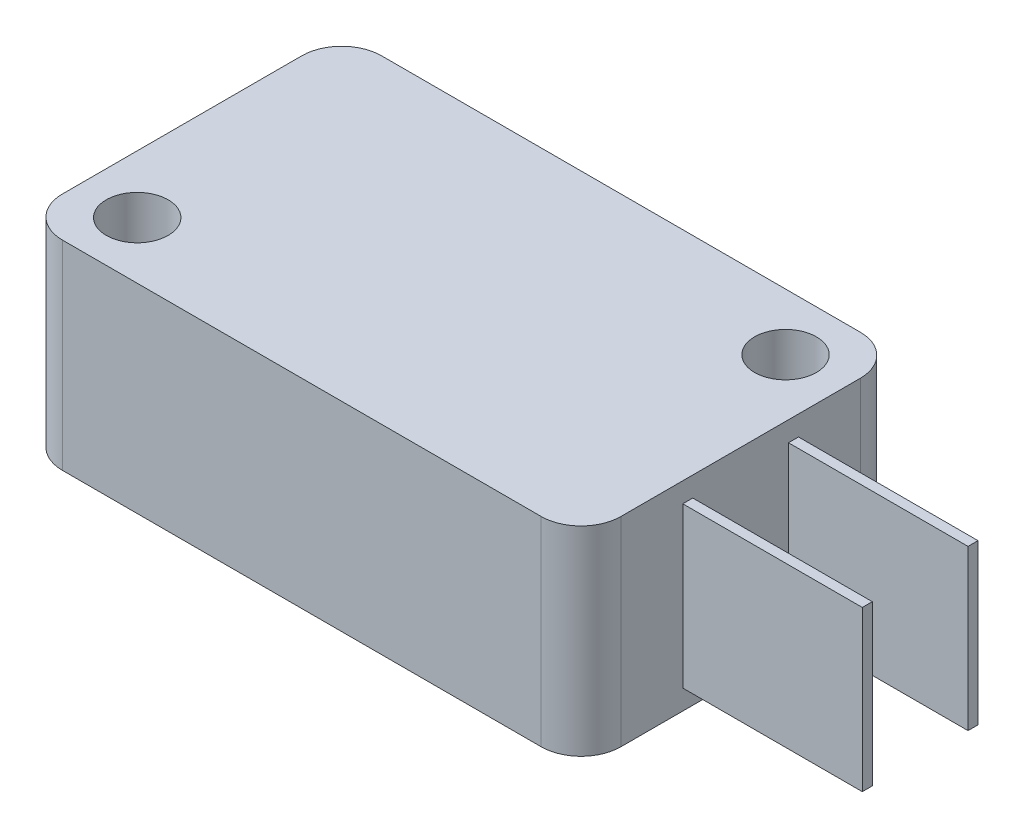
ISO-10303-21;
HEADER;
FILE_DESCRIPTION(('STEP AP214'),'2;1');
FILE_NAME('part.step','',(''),(''),'','','');
FILE_SCHEMA(('AUTOMOTIVE_DESIGN { 1 0 10303 214 1 1 1 1 }'));
ENDSEC;
DATA;
#1=APPLICATION_CONTEXT('core data for automotive mechanical design processes');
#2=APPLICATION_PROTOCOL_DEFINITION('international standard','automotive_design',2000,#1);
#3=PRODUCT_CONTEXT('',#1,'mechanical');
#4=PRODUCT('Part','Part','',(#3));
#5=PRODUCT_RELATED_PRODUCT_CATEGORY('part','',(#4));
#6=PRODUCT_DEFINITION_FORMATION('','',#4);
#7=PRODUCT_DEFINITION_CONTEXT('part definition',#1,'design');
#8=PRODUCT_DEFINITION('design','',#6,#7);
#9=PRODUCT_DEFINITION_SHAPE('','',#8);
#10=(LENGTH_UNIT() NAMED_UNIT(*) SI_UNIT(.MILLI.,.METRE.));
#11=(NAMED_UNIT(*) PLANE_ANGLE_UNIT() SI_UNIT($,.RADIAN.));
#12=(NAMED_UNIT(*) SI_UNIT($,.STERADIAN.) SOLID_ANGLE_UNIT());
#13=UNCERTAINTY_MEASURE_WITH_UNIT(LENGTH_MEASURE(1.E-05),#10,'distance_accuracy_value','');
#14=(GEOMETRIC_REPRESENTATION_CONTEXT(3) GLOBAL_UNCERTAINTY_ASSIGNED_CONTEXT((#13)) GLOBAL_UNIT_ASSIGNED_CONTEXT((#10,
#11,#12)) REPRESENTATION_CONTEXT('',''));
#15=CARTESIAN_POINT('',(0.,0.,0.));
#16=DIRECTION('',(0.,0.,1.));
#17=DIRECTION('',(1.,0.,0.));
#18=AXIS2_PLACEMENT_3D('',#15,#16,#17);
#19=CARTESIAN_POINT('',(-14.,10.,-8.));
#20=DIRECTION('',(0.,0.,1.));
#21=DIRECTION('',(1.,0.,0.));
#22=AXIS2_PLACEMENT_3D('',#19,#20,#21);
#23=PLANE('',#22);
#24=DIRECTION('',(-1.,0.,0.));
#25=VECTOR('',#24,1.);
#26=CARTESIAN_POINT('',(-14.,0.,-8.));
#27=LINE('',#26,#25);
#28=CARTESIAN_POINT('',(12.,0.,-8.));
#29=VERTEX_POINT('',#28);
#30=CARTESIAN_POINT('',(-12.,0.,-8.));
#31=VERTEX_POINT('',#30);
#32=EDGE_CURVE('E300',#29,#31,#27,.T.);
#33=ORIENTED_EDGE('',*,*,#32,.T.);
#34=DIRECTION('',(0.,-1.,0.));
#35=VECTOR('',#34,1.);
#36=CARTESIAN_POINT('',(-12.,10.,-8.));
#37=LINE('',#36,#35);
#38=CARTESIAN_POINT('',(-12.,10.,-8.));
#39=VERTEX_POINT('',#38);
#40=EDGE_CURVE('E335',#31,#39,#37,.F.);
#41=ORIENTED_EDGE('',*,*,#40,.T.);
#42=DIRECTION('',(-1.,0.,0.));
#43=VECTOR('',#42,1.);
#44=CARTESIAN_POINT('',(-14.,10.,-8.));
#45=LINE('',#44,#43);
#46=CARTESIAN_POINT('',(12.,10.,-8.));
#47=VERTEX_POINT('',#46);
#48=EDGE_CURVE('E306',#47,#39,#45,.T.);
#49=ORIENTED_EDGE('',*,*,#48,.F.);
#50=DIRECTION('',(0.,-1.,0.));
#51=VECTOR('',#50,1.);
#52=CARTESIAN_POINT('',(12.,10.,-8.));
#53=LINE('',#52,#51);
#54=EDGE_CURVE('E332',#47,#29,#53,.T.);
#55=ORIENTED_EDGE('',*,*,#54,.T.);
#56=EDGE_LOOP('',(#33,#41,#49,#55));
#57=FACE_BOUND('',#56,.T.);
#58=DIRECTION('',(0.,-1.,0.));
#59=VECTOR('',#58,1.);
#60=CARTESIAN_POINT('',(-4.96556421839944,6.5,-8.));
#61=LINE('',#60,#59);
#62=CARTESIAN_POINT('',(-4.96556421839944,6.5,-8.));
#63=VERTEX_POINT('',#62);
#64=CARTESIAN_POINT('',(-4.96556421839944,3.5,-8.));
#65=VERTEX_POINT('',#64);
#66=EDGE_CURVE('E185',#63,#65,#61,.T.);
#67=ORIENTED_EDGE('',*,*,#66,.F.);
#68=DIRECTION('',(1.,0.,0.));
#69=VECTOR('',#68,1.);
#70=CARTESIAN_POINT('',(-4.96556421839944,6.5,-8.));
#71=LINE('',#70,#69);
#72=CARTESIAN_POINT('',(-7.96556421839944,6.5,-8.));
#73=VERTEX_POINT('',#72);
#74=EDGE_CURVE('E197',#73,#63,#71,.T.);
#75=ORIENTED_EDGE('',*,*,#74,.F.);
#76=DIRECTION('',(0.,1.,0.));
#77=VECTOR('',#76,1.);
#78=CARTESIAN_POINT('',(-7.96556421839944,6.5,-8.));
#79=LINE('',#78,#77);
#80=CARTESIAN_POINT('',(-7.96556421839944,3.5,-8.));
#81=VERTEX_POINT('',#80);
#82=EDGE_CURVE('E205',#81,#73,#79,.T.);
#83=ORIENTED_EDGE('',*,*,#82,.F.);
#84=DIRECTION('',(-1.,0.,0.));
#85=VECTOR('',#84,1.);
#86=CARTESIAN_POINT('',(-4.96556421839944,3.5,-8.));
#87=LINE('',#86,#85);
#88=EDGE_CURVE('E200',#65,#81,#87,.T.);
#89=ORIENTED_EDGE('',*,*,#88,.F.);
#90=EDGE_LOOP('',(#67,#75,#83,#89));
#91=FACE_BOUND('',#90,.T.);
#92=ADVANCED_FACE('F33',(#57,#91),#23,.F.);
#93=CARTESIAN_POINT('',(14.,10.,-8.));
#94=DIRECTION('',(-1.,0.,0.));
#95=DIRECTION('',(0.,0.,1.));
#96=AXIS2_PLACEMENT_3D('',#93,#94,#95);
#97=PLANE('',#96);
#98=DIRECTION('',(0.,-1.,0.));
#99=VECTOR('',#98,1.);
#100=CARTESIAN_POINT('',(14.,9.,2.9));
#101=LINE('',#100,#99);
#102=CARTESIAN_POINT('',(14.,9.,2.9));
#103=VERTEX_POINT('',#102);
#104=CARTESIAN_POINT('',(14.,1.,2.89999999999999));
#105=VERTEX_POINT('',#104);
#106=EDGE_CURVE('E250',#103,#105,#101,.T.);
#107=ORIENTED_EDGE('',*,*,#106,.F.);
#108=DIRECTION('',(0.,0.,1.));
#109=VECTOR('',#108,1.);
#110=CARTESIAN_POINT('',(14.,9.,2.9));
#111=LINE('',#110,#109);
#112=CARTESIAN_POINT('',(14.,9.,2.39999999999999));
#113=VERTEX_POINT('',#112);
#114=EDGE_CURVE('E255',#113,#103,#111,.T.);
#115=ORIENTED_EDGE('',*,*,#114,.F.);
#116=DIRECTION('',(0.,1.,0.));
#117=VECTOR('',#116,1.);
#118=CARTESIAN_POINT('',(14.,9.,2.4));
#119=LINE('',#118,#117);
#120=CARTESIAN_POINT('',(14.,1.,2.4));
#121=VERTEX_POINT('',#120);
#122=EDGE_CURVE('E267',#121,#113,#119,.T.);
#123=ORIENTED_EDGE('',*,*,#122,.F.);
#124=DIRECTION('',(0.,0.,-1.));
#125=VECTOR('',#124,1.);
#126=CARTESIAN_POINT('',(14.,1.,2.89999999999999));
#127=LINE('',#126,#125);
#128=EDGE_CURVE('E264',#105,#121,#127,.T.);
#129=ORIENTED_EDGE('',*,*,#128,.F.);
#130=EDGE_LOOP('',(#107,#115,#123,#129));
#131=FACE_BOUND('',#130,.T.);
#132=DIRECTION('',(0.,0.,-1.));
#133=VECTOR('',#132,1.);
#134=CARTESIAN_POINT('',(14.,0.,-8.));
#135=LINE('',#134,#133);
#136=CARTESIAN_POINT('',(14.,0.,6.));
#137=VERTEX_POINT('',#136);
#138=CARTESIAN_POINT('',(14.,0.,-6.));
#139=VERTEX_POINT('',#138);
#140=EDGE_CURVE('E315',#137,#139,#135,.T.);
#141=ORIENTED_EDGE('',*,*,#140,.T.);
#142=DIRECTION('',(0.,-1.,0.));
#143=VECTOR('',#142,1.);
#144=CARTESIAN_POINT('',(14.,10.,-6.));
#145=LINE('',#144,#143);
#146=CARTESIAN_POINT('',(14.,10.,-6.));
#147=VERTEX_POINT('',#146);
#148=EDGE_CURVE('E348',#139,#147,#145,.F.);
#149=ORIENTED_EDGE('',*,*,#148,.T.);
#150=DIRECTION('',(0.,0.,-1.));
#151=VECTOR('',#150,1.);
#152=CARTESIAN_POINT('',(14.,10.,-8.));
#153=LINE('',#152,#151);
#154=CARTESIAN_POINT('',(14.,10.,6.));
#155=VERTEX_POINT('',#154);
#156=EDGE_CURVE('E303',#155,#147,#153,.T.);
#157=ORIENTED_EDGE('',*,*,#156,.F.);
#158=DIRECTION('',(0.,-1.,0.));
#159=VECTOR('',#158,1.);
#160=CARTESIAN_POINT('',(14.,10.,6.));
#161=LINE('',#160,#159);
#162=EDGE_CURVE('E345',#155,#137,#161,.T.);
#163=ORIENTED_EDGE('',*,*,#162,.T.);
#164=EDGE_LOOP('',(#141,#149,#157,#163));
#165=FACE_BOUND('',#164,.T.);
#166=DIRECTION('',(0.,-1.,0.));
#167=VECTOR('',#166,1.);
#168=CARTESIAN_POINT('',(14.,9.,-2.4));
#169=LINE('',#168,#167);
#170=CARTESIAN_POINT('',(14.,9.,-2.4));
#171=VERTEX_POINT('',#170);
#172=CARTESIAN_POINT('',(14.,1.,-2.4));
#173=VERTEX_POINT('',#172);
#174=EDGE_CURVE('E217',#171,#173,#169,.T.);
#175=ORIENTED_EDGE('',*,*,#174,.F.);
#176=DIRECTION('',(0.,0.,1.));
#177=VECTOR('',#176,1.);
#178=CARTESIAN_POINT('',(14.,9.,-2.4));
#179=LINE('',#178,#177);
#180=CARTESIAN_POINT('',(14.,9.,-2.90000000000001));
#181=VERTEX_POINT('',#180);
#182=EDGE_CURVE('E222',#181,#171,#179,.T.);
#183=ORIENTED_EDGE('',*,*,#182,.F.);
#184=DIRECTION('',(0.,1.,0.));
#185=VECTOR('',#184,1.);
#186=CARTESIAN_POINT('',(14.,9.,-2.9));
#187=LINE('',#186,#185);
#188=CARTESIAN_POINT('',(14.,1.,-2.90000000000001));
#189=VERTEX_POINT('',#188);
#190=EDGE_CURVE('E234',#189,#181,#187,.T.);
#191=ORIENTED_EDGE('',*,*,#190,.F.);
#192=DIRECTION('',(0.,0.,-1.));
#193=VECTOR('',#192,1.);
#194=CARTESIAN_POINT('',(14.,1.,-2.40000000000001));
#195=LINE('',#194,#193);
#196=EDGE_CURVE('E231',#173,#189,#195,.T.);
#197=ORIENTED_EDGE('',*,*,#196,.F.);
#198=EDGE_LOOP('',(#175,#183,#191,#197));
#199=FACE_BOUND('',#198,.T.);
#200=ADVANCED_FACE('F383',(#131,#165,#199),#97,.F.);
#201=CARTESIAN_POINT('',(-14.,10.,-8.));
#202=DIRECTION('',(1.,0.,0.));
#203=DIRECTION('',(0.,0.,-1.));
#204=AXIS2_PLACEMENT_3D('',#201,#202,#203);
#205=PLANE('',#204);
#206=DIRECTION('',(0.,0.,1.));
#207=VECTOR('',#206,1.);
#208=CARTESIAN_POINT('',(-14.,10.,-8.));
#209=LINE('',#208,#207);
#210=CARTESIAN_POINT('',(-14.,10.,-6.));
#211=VERTEX_POINT('',#210);
#212=CARTESIAN_POINT('',(-14.,10.,6.));
#213=VERTEX_POINT('',#212);
#214=EDGE_CURVE('E296',#211,#213,#209,.T.);
#215=ORIENTED_EDGE('',*,*,#214,.F.);
#216=DIRECTION('',(0.,-1.,0.));
#217=VECTOR('',#216,1.);
#218=CARTESIAN_POINT('',(-14.,10.,-6.));
#219=LINE('',#218,#217);
#220=CARTESIAN_POINT('',(-14.,0.,-6.));
#221=VERTEX_POINT('',#220);
#222=EDGE_CURVE('E321',#211,#221,#219,.T.);
#223=ORIENTED_EDGE('',*,*,#222,.T.);
#224=DIRECTION('',(0.,0.,1.));
#225=VECTOR('',#224,1.);
#226=CARTESIAN_POINT('',(-14.,0.,-8.));
#227=LINE('',#226,#225);
#228=CARTESIAN_POINT('',(-14.,0.,6.));
#229=VERTEX_POINT('',#228);
#230=EDGE_CURVE('E293',#221,#229,#227,.T.);
#231=ORIENTED_EDGE('',*,*,#230,.T.);
#232=DIRECTION('',(0.,-1.,0.));
#233=VECTOR('',#232,1.);
#234=CARTESIAN_POINT('',(-14.,10.,6.));
#235=LINE('',#234,#233);
#236=EDGE_CURVE('E309',#229,#213,#235,.F.);
#237=ORIENTED_EDGE('',*,*,#236,.T.);
#238=EDGE_LOOP('',(#215,#223,#231,#237));
#239=FACE_BOUND('',#238,.T.);
#240=ADVANCED_FACE('F389',(#239),#205,.F.);
#241=CARTESIAN_POINT('',(-14.,10.,8.));
#242=DIRECTION('',(0.,0.,-1.));
#243=DIRECTION('',(-1.,0.,0.));
#244=AXIS2_PLACEMENT_3D('',#241,#242,#243);
#245=PLANE('',#244);
#246=DIRECTION('',(1.,0.,0.));
#247=VECTOR('',#246,1.);
#248=CARTESIAN_POINT('',(-14.,0.,8.));
#249=LINE('',#248,#247);
#250=CARTESIAN_POINT('',(-12.,0.,8.));
#251=VERTEX_POINT('',#250);
#252=CARTESIAN_POINT('',(12.,0.,8.));
#253=VERTEX_POINT('',#252);
#254=EDGE_CURVE('E312',#251,#253,#249,.T.);
#255=ORIENTED_EDGE('',*,*,#254,.T.);
#256=DIRECTION('',(0.,-1.,0.));
#257=VECTOR('',#256,1.);
#258=CARTESIAN_POINT('',(12.,10.,8.));
#259=LINE('',#258,#257);
#260=CARTESIAN_POINT('',(12.,10.,8.));
#261=VERTEX_POINT('',#260);
#262=EDGE_CURVE('E353',#253,#261,#259,.F.);
#263=ORIENTED_EDGE('',*,*,#262,.T.);
#264=DIRECTION('',(1.,0.,0.));
#265=VECTOR('',#264,1.);
#266=CARTESIAN_POINT('',(-14.,10.,8.));
#267=LINE('',#266,#265);
#268=CARTESIAN_POINT('',(-12.,10.,8.));
#269=VERTEX_POINT('',#268);
#270=EDGE_CURVE('E299',#269,#261,#267,.T.);
#271=ORIENTED_EDGE('',*,*,#270,.F.);
#272=DIRECTION('',(0.,-1.,0.));
#273=VECTOR('',#272,1.);
#274=CARTESIAN_POINT('',(-12.,10.,8.));
#275=LINE('',#274,#273);
#276=EDGE_CURVE('E350',#269,#251,#275,.T.);
#277=ORIENTED_EDGE('',*,*,#276,.T.);
#278=EDGE_LOOP('',(#255,#263,#271,#277));
#279=FACE_BOUND('',#278,.T.);
#280=ADVANCED_FACE('F396',(#279),#245,.F.);
#281=CARTESIAN_POINT('',(0.,10.,0.));
#282=DIRECTION('',(0.,1.,0.));
#283=DIRECTION('',(0.,0.,1.));
#284=AXIS2_PLACEMENT_3D('',#281,#282,#283);
#285=PLANE('',#284);
#286=CARTESIAN_POINT('',(-11.0999999999995,10.,5.14999999999311));
#287=DIRECTION('',(0.,1.,0.));
#288=DIRECTION('',(0.,0.,1.));
#289=AXIS2_PLACEMENT_3D('',#286,#287,#288);
#290=CIRCLE('',#289,1.55);
#291=CARTESIAN_POINT('',(-11.0999999999995,10.,6.69999999999311));
#292=VERTEX_POINT('',#291);
#293=EDGE_CURVE('E283',#292,#292,#290,.T.);
#294=ORIENTED_EDGE('',*,*,#293,.F.);
#295=EDGE_LOOP('',(#294));
#296=FACE_BOUND('',#295,.T.);
#297=CARTESIAN_POINT('',(11.0999999999995,10.,-5.14999999999311));
#298=DIRECTION('',(0.,1.,0.));
#299=DIRECTION('',(0.,0.,1.));
#300=AXIS2_PLACEMENT_3D('',#297,#298,#299);
#301=CIRCLE('',#300,1.55);
#302=CARTESIAN_POINT('',(11.0999999999995,10.,-3.59999999999311));
#303=VERTEX_POINT('',#302);
#304=EDGE_CURVE('E287',#303,#303,#301,.T.);
#305=ORIENTED_EDGE('',*,*,#304,.F.);
#306=EDGE_LOOP('',(#305));
#307=FACE_BOUND('',#306,.T.);
#308=ORIENTED_EDGE('',*,*,#48,.T.);
#309=CARTESIAN_POINT('',(-12.,10.,-6.));
#310=DIRECTION('',(0.,1.,0.));
#311=DIRECTION('',(0.,0.,1.));
#312=AXIS2_PLACEMENT_3D('',#309,#310,#311);
#313=CIRCLE('',#312,2.);
#314=EDGE_CURVE('E343',#39,#211,#313,.T.);
#315=ORIENTED_EDGE('',*,*,#314,.T.);
#316=ORIENTED_EDGE('',*,*,#214,.T.);
#317=CARTESIAN_POINT('',(-12.,10.,6.));
#318=DIRECTION('',(0.,1.,0.));
#319=DIRECTION('',(0.,0.,1.));
#320=AXIS2_PLACEMENT_3D('',#317,#318,#319);
#321=CIRCLE('',#320,2.);
#322=EDGE_CURVE('E337',#213,#269,#321,.T.);
#323=ORIENTED_EDGE('',*,*,#322,.T.);
#324=ORIENTED_EDGE('',*,*,#270,.T.);
#325=CARTESIAN_POINT('',(12.,10.,6.));
#326=DIRECTION('',(0.,1.,0.));
#327=DIRECTION('',(0.,0.,1.));
#328=AXIS2_PLACEMENT_3D('',#325,#326,#327);
#329=CIRCLE('',#328,2.);
#330=EDGE_CURVE('E339',#261,#155,#329,.T.);
#331=ORIENTED_EDGE('',*,*,#330,.T.);
#332=ORIENTED_EDGE('',*,*,#156,.T.);
#333=CARTESIAN_POINT('',(12.,10.,-6.));
#334=DIRECTION('',(0.,1.,0.));
#335=DIRECTION('',(0.,0.,1.));
#336=AXIS2_PLACEMENT_3D('',#333,#334,#335);
#337=CIRCLE('',#336,2.);
#338=EDGE_CURVE('E341',#147,#47,#337,.T.);
#339=ORIENTED_EDGE('',*,*,#338,.T.);
#340=EDGE_LOOP('',(#308,#315,#316,#323,#324,#331,#332,#339));
#341=FACE_BOUND('',#340,.T.);
#342=ADVANCED_FACE('F399',(#296,#307,#341),#285,.T.);
#343=CARTESIAN_POINT('',(0.,0.,0.));
#344=DIRECTION('',(0.,1.,0.));
#345=DIRECTION('',(0.,0.,1.));
#346=AXIS2_PLACEMENT_3D('',#343,#344,#345);
#347=PLANE('',#346);
#348=CARTESIAN_POINT('',(-11.0999999999995,0.,5.14999999999311));
#349=DIRECTION('',(0.,1.,0.));
#350=DIRECTION('',(0.,0.,1.));
#351=AXIS2_PLACEMENT_3D('',#348,#349,#350);
#352=CIRCLE('',#351,1.55);
#353=CARTESIAN_POINT('',(-11.0999999999995,0.,6.69999999999311));
#354=VERTEX_POINT('',#353);
#355=EDGE_CURVE('E284',#354,#354,#352,.T.);
#356=ORIENTED_EDGE('',*,*,#355,.T.);
#357=EDGE_LOOP('',(#356));
#358=FACE_BOUND('',#357,.T.);
#359=CARTESIAN_POINT('',(11.0999999999995,0.,-5.14999999999311));
#360=DIRECTION('',(0.,1.,0.));
#361=DIRECTION('',(0.,0.,1.));
#362=AXIS2_PLACEMENT_3D('',#359,#360,#361);
#363=CIRCLE('',#362,1.55);
#364=CARTESIAN_POINT('',(11.0999999999995,0.,-3.59999999999311));
#365=VERTEX_POINT('',#364);
#366=EDGE_CURVE('E290',#365,#365,#363,.T.);
#367=ORIENTED_EDGE('',*,*,#366,.T.);
#368=EDGE_LOOP('',(#367));
#369=FACE_BOUND('',#368,.T.);
#370=ORIENTED_EDGE('',*,*,#230,.F.);
#371=CARTESIAN_POINT('',(-12.,0.,-6.));
#372=DIRECTION('',(0.,1.,0.));
#373=DIRECTION('',(0.,0.,1.));
#374=AXIS2_PLACEMENT_3D('',#371,#372,#373);
#375=CIRCLE('',#374,2.);
#376=EDGE_CURVE('E330',#221,#31,#375,.F.);
#377=ORIENTED_EDGE('',*,*,#376,.T.);
#378=ORIENTED_EDGE('',*,*,#32,.F.);
#379=CARTESIAN_POINT('',(12.,0.,-6.));
#380=DIRECTION('',(0.,1.,0.));
#381=DIRECTION('',(0.,0.,1.));
#382=AXIS2_PLACEMENT_3D('',#379,#380,#381);
#383=CIRCLE('',#382,2.);
#384=EDGE_CURVE('E328',#29,#139,#383,.F.);
#385=ORIENTED_EDGE('',*,*,#384,.T.);
#386=ORIENTED_EDGE('',*,*,#140,.F.);
#387=CARTESIAN_POINT('',(12.,0.,6.));
#388=DIRECTION('',(0.,1.,0.));
#389=DIRECTION('',(0.,0.,1.));
#390=AXIS2_PLACEMENT_3D('',#387,#388,#389);
#391=CIRCLE('',#390,2.);
#392=EDGE_CURVE('E326',#137,#253,#391,.F.);
#393=ORIENTED_EDGE('',*,*,#392,.T.);
#394=ORIENTED_EDGE('',*,*,#254,.F.);
#395=CARTESIAN_POINT('',(-12.,0.,6.));
#396=DIRECTION('',(0.,1.,0.));
#397=DIRECTION('',(0.,0.,1.));
#398=AXIS2_PLACEMENT_3D('',#395,#396,#397);
#399=CIRCLE('',#398,2.);
#400=EDGE_CURVE('E324',#251,#229,#399,.F.);
#401=ORIENTED_EDGE('',*,*,#400,.T.);
#402=EDGE_LOOP('',(#370,#377,#378,#385,#386,#393,#394,#401));
#403=FACE_BOUND('',#402,.T.);
#404=ADVANCED_FACE('F393',(#358,#369,#403),#347,.F.);
#405=CARTESIAN_POINT('',(-12.,10.,-6.));
#406=DIRECTION('',(0.,-1.,0.));
#407=DIRECTION('',(0.,0.,-1.));
#408=AXIS2_PLACEMENT_3D('',#405,#406,#407);
#409=CYLINDRICAL_SURFACE('',#408,2.);
#410=ORIENTED_EDGE('',*,*,#314,.F.);
#411=ORIENTED_EDGE('',*,*,#40,.F.);
#412=ORIENTED_EDGE('',*,*,#376,.F.);
#413=ORIENTED_EDGE('',*,*,#222,.F.);
#414=EDGE_LOOP('',(#410,#411,#412,#413));
#415=FACE_BOUND('',#414,.T.);
#416=ADVANCED_FACE('F404',(#415),#409,.T.);
#417=CARTESIAN_POINT('',(12.,10.,-6.));
#418=DIRECTION('',(0.,-1.,0.));
#419=DIRECTION('',(0.,0.,-1.));
#420=AXIS2_PLACEMENT_3D('',#417,#418,#419);
#421=CYLINDRICAL_SURFACE('',#420,2.);
#422=ORIENTED_EDGE('',*,*,#338,.F.);
#423=ORIENTED_EDGE('',*,*,#148,.F.);
#424=ORIENTED_EDGE('',*,*,#384,.F.);
#425=ORIENTED_EDGE('',*,*,#54,.F.);
#426=EDGE_LOOP('',(#422,#423,#424,#425));
#427=FACE_BOUND('',#426,.T.);
#428=ADVANCED_FACE('F407',(#427),#421,.T.);
#429=CARTESIAN_POINT('',(12.,10.,6.));
#430=DIRECTION('',(0.,-1.,0.));
#431=DIRECTION('',(0.,0.,-1.));
#432=AXIS2_PLACEMENT_3D('',#429,#430,#431);
#433=CYLINDRICAL_SURFACE('',#432,2.);
#434=ORIENTED_EDGE('',*,*,#330,.F.);
#435=ORIENTED_EDGE('',*,*,#262,.F.);
#436=ORIENTED_EDGE('',*,*,#392,.F.);
#437=ORIENTED_EDGE('',*,*,#162,.F.);
#438=EDGE_LOOP('',(#434,#435,#436,#437));
#439=FACE_BOUND('',#438,.T.);
#440=ADVANCED_FACE('F411',(#439),#433,.T.);
#441=CARTESIAN_POINT('',(-12.,10.,6.));
#442=DIRECTION('',(0.,-1.,0.));
#443=DIRECTION('',(0.,0.,-1.));
#444=AXIS2_PLACEMENT_3D('',#441,#442,#443);
#445=CYLINDRICAL_SURFACE('',#444,2.);
#446=ORIENTED_EDGE('',*,*,#322,.F.);
#447=ORIENTED_EDGE('',*,*,#236,.F.);
#448=ORIENTED_EDGE('',*,*,#400,.F.);
#449=ORIENTED_EDGE('',*,*,#276,.F.);
#450=EDGE_LOOP('',(#446,#447,#448,#449));
#451=FACE_BOUND('',#450,.T.);
#452=ADVANCED_FACE('F415',(#451),#445,.T.);
#453=CARTESIAN_POINT('',(11.0999999999995,0.,-5.14999999999311));
#454=DIRECTION('',(0.,1.,0.));
#455=DIRECTION('',(0.,0.,1.));
#456=AXIS2_PLACEMENT_3D('',#453,#454,#455);
#457=CYLINDRICAL_SURFACE('',#456,1.55);
#458=ORIENTED_EDGE('',*,*,#366,.F.);
#459=EDGE_LOOP('',(#458));
#460=FACE_BOUND('',#459,.T.);
#461=ORIENTED_EDGE('',*,*,#304,.T.);
#462=EDGE_LOOP('',(#461));
#463=FACE_BOUND('',#462,.T.);
#464=ADVANCED_FACE('F418',(#460,#463),#457,.F.);
#465=CARTESIAN_POINT('',(-11.0999999999995,0.,5.14999999999311));
#466=DIRECTION('',(0.,1.,0.));
#467=DIRECTION('',(0.,0.,1.));
#468=AXIS2_PLACEMENT_3D('',#465,#466,#467);
#469=CYLINDRICAL_SURFACE('',#468,1.55);
#470=ORIENTED_EDGE('',*,*,#355,.F.);
#471=EDGE_LOOP('',(#470));
#472=FACE_BOUND('',#471,.T.);
#473=ORIENTED_EDGE('',*,*,#293,.T.);
#474=EDGE_LOOP('',(#473));
#475=FACE_BOUND('',#474,.T.);
#476=ADVANCED_FACE('F423',(#472,#475),#469,.F.);
#477=CARTESIAN_POINT('',(23.,9.,2.89999999999999));
#478=DIRECTION('',(0.,0.,-1.));
#479=DIRECTION('',(-1.,0.,0.));
#480=AXIS2_PLACEMENT_3D('',#477,#478,#479);
#481=PLANE('',#480);
#482=ORIENTED_EDGE('',*,*,#106,.T.);
#483=DIRECTION('',(-1.,0.,0.));
#484=VECTOR('',#483,1.);
#485=CARTESIAN_POINT('',(23.,1.,2.89999999999999));
#486=LINE('',#485,#484);
#487=CARTESIAN_POINT('',(23.,1.,2.89999999999999));
#488=VERTEX_POINT('',#487);
#489=EDGE_CURVE('E280',#488,#105,#486,.T.);
#490=ORIENTED_EDGE('',*,*,#489,.F.);
#491=DIRECTION('',(0.,-1.,0.));
#492=VECTOR('',#491,1.);
#493=CARTESIAN_POINT('',(23.,9.,2.89999999999999));
#494=LINE('',#493,#492);
#495=CARTESIAN_POINT('',(23.,9.,2.89999999999999));
#496=VERTEX_POINT('',#495);
#497=EDGE_CURVE('E251',#496,#488,#494,.T.);
#498=ORIENTED_EDGE('',*,*,#497,.F.);
#499=DIRECTION('',(-1.,0.,0.));
#500=VECTOR('',#499,1.);
#501=CARTESIAN_POINT('',(23.,9.,2.89999999999999));
#502=LINE('',#501,#500);
#503=EDGE_CURVE('E261',#496,#103,#502,.T.);
#504=ORIENTED_EDGE('',*,*,#503,.T.);
#505=EDGE_LOOP('',(#482,#490,#498,#504));
#506=FACE_BOUND('',#505,.T.);
#507=ADVANCED_FACE('F465',(#506),#481,.F.);
#508=CARTESIAN_POINT('',(23.,1.,2.89999999999999));
#509=DIRECTION('',(0.,1.,0.));
#510=DIRECTION('',(0.,0.,1.));
#511=AXIS2_PLACEMENT_3D('',#508,#509,#510);
#512=PLANE('',#511);
#513=ORIENTED_EDGE('',*,*,#128,.T.);
#514=DIRECTION('',(-1.,0.,0.));
#515=VECTOR('',#514,1.);
#516=CARTESIAN_POINT('',(23.,1.,2.39999999999999));
#517=LINE('',#516,#515);
#518=CARTESIAN_POINT('',(23.,1.,2.39999999999999));
#519=VERTEX_POINT('',#518);
#520=EDGE_CURVE('E277',#519,#121,#517,.T.);
#521=ORIENTED_EDGE('',*,*,#520,.F.);
#522=DIRECTION('',(0.,0.,-1.));
#523=VECTOR('',#522,1.);
#524=CARTESIAN_POINT('',(23.,1.,2.89999999999999));
#525=LINE('',#524,#523);
#526=EDGE_CURVE('E254',#488,#519,#525,.T.);
#527=ORIENTED_EDGE('',*,*,#526,.F.);
#528=ORIENTED_EDGE('',*,*,#489,.T.);
#529=EDGE_LOOP('',(#513,#521,#527,#528));
#530=FACE_BOUND('',#529,.T.);
#531=ADVANCED_FACE('F471',(#530),#512,.F.);
#532=CARTESIAN_POINT('',(23.,9.,2.39999999999999));
#533=DIRECTION('',(0.,0.,1.));
#534=DIRECTION('',(1.,0.,0.));
#535=AXIS2_PLACEMENT_3D('',#532,#533,#534);
#536=PLANE('',#535);
#537=ORIENTED_EDGE('',*,*,#122,.T.);
#538=DIRECTION('',(-1.,0.,0.));
#539=VECTOR('',#538,1.);
#540=CARTESIAN_POINT('',(23.,9.,2.39999999999999));
#541=LINE('',#540,#539);
#542=CARTESIAN_POINT('',(23.,9.,2.39999999999999));
#543=VERTEX_POINT('',#542);
#544=EDGE_CURVE('E274',#543,#113,#541,.T.);
#545=ORIENTED_EDGE('',*,*,#544,.F.);
#546=DIRECTION('',(0.,1.,0.));
#547=VECTOR('',#546,1.);
#548=CARTESIAN_POINT('',(23.,9.,2.39999999999999));
#549=LINE('',#548,#547);
#550=EDGE_CURVE('E257',#519,#543,#549,.T.);
#551=ORIENTED_EDGE('',*,*,#550,.F.);
#552=ORIENTED_EDGE('',*,*,#520,.T.);
#553=EDGE_LOOP('',(#537,#545,#551,#552));
#554=FACE_BOUND('',#553,.T.);
#555=ADVANCED_FACE('F477',(#554),#536,.F.);
#556=CARTESIAN_POINT('',(23.,9.,2.89999999999999));
#557=DIRECTION('',(0.,-1.,0.));
#558=DIRECTION('',(0.,0.,-1.));
#559=AXIS2_PLACEMENT_3D('',#556,#557,#558);
#560=PLANE('',#559);
#561=ORIENTED_EDGE('',*,*,#114,.T.);
#562=ORIENTED_EDGE('',*,*,#503,.F.);
#563=DIRECTION('',(0.,0.,1.));
#564=VECTOR('',#563,1.);
#565=CARTESIAN_POINT('',(23.,9.,2.89999999999999));
#566=LINE('',#565,#564);
#567=EDGE_CURVE('E259',#543,#496,#566,.T.);
#568=ORIENTED_EDGE('',*,*,#567,.F.);
#569=ORIENTED_EDGE('',*,*,#544,.T.);
#570=EDGE_LOOP('',(#561,#562,#568,#569));
#571=FACE_BOUND('',#570,.T.);
#572=ADVANCED_FACE('F481',(#571),#560,.F.);
#573=CARTESIAN_POINT('',(23.,0.,0.));
#574=DIRECTION('',(1.,0.,0.));
#575=DIRECTION('',(0.,0.,-1.));
#576=AXIS2_PLACEMENT_3D('',#573,#574,#575);
#577=PLANE('',#576);
#578=ORIENTED_EDGE('',*,*,#497,.T.);
#579=ORIENTED_EDGE('',*,*,#526,.T.);
#580=ORIENTED_EDGE('',*,*,#550,.T.);
#581=ORIENTED_EDGE('',*,*,#567,.T.);
#582=EDGE_LOOP('',(#578,#579,#580,#581));
#583=FACE_BOUND('',#582,.T.);
#584=ADVANCED_FACE('F485',(#583),#577,.T.);
#585=CARTESIAN_POINT('',(23.,9.,-2.40000000000001));
#586=DIRECTION('',(0.,0.,-1.));
#587=DIRECTION('',(-1.,0.,0.));
#588=AXIS2_PLACEMENT_3D('',#585,#586,#587);
#589=PLANE('',#588);
#590=ORIENTED_EDGE('',*,*,#174,.T.);
#591=DIRECTION('',(-1.,0.,0.));
#592=VECTOR('',#591,1.);
#593=CARTESIAN_POINT('',(23.,1.,-2.40000000000001));
#594=LINE('',#593,#592);
#595=CARTESIAN_POINT('',(23.,1.,-2.40000000000001));
#596=VERTEX_POINT('',#595);
#597=EDGE_CURVE('E247',#596,#173,#594,.T.);
#598=ORIENTED_EDGE('',*,*,#597,.F.);
#599=DIRECTION('',(0.,-1.,0.));
#600=VECTOR('',#599,1.);
#601=CARTESIAN_POINT('',(23.,9.,-2.40000000000001));
#602=LINE('',#601,#600);
#603=CARTESIAN_POINT('',(23.,9.,-2.40000000000001));
#604=VERTEX_POINT('',#603);
#605=EDGE_CURVE('E218',#604,#596,#602,.T.);
#606=ORIENTED_EDGE('',*,*,#605,.F.);
#607=DIRECTION('',(-1.,0.,0.));
#608=VECTOR('',#607,1.);
#609=CARTESIAN_POINT('',(23.,9.,-2.40000000000001));
#610=LINE('',#609,#608);
#611=EDGE_CURVE('E228',#604,#171,#610,.T.);
#612=ORIENTED_EDGE('',*,*,#611,.T.);
#613=EDGE_LOOP('',(#590,#598,#606,#612));
#614=FACE_BOUND('',#613,.T.);
#615=ADVANCED_FACE('F489',(#614),#589,.F.);
#616=CARTESIAN_POINT('',(23.,1.,-2.40000000000001));
#617=DIRECTION('',(0.,1.,0.));
#618=DIRECTION('',(0.,0.,1.));
#619=AXIS2_PLACEMENT_3D('',#616,#617,#618);
#620=PLANE('',#619);
#621=ORIENTED_EDGE('',*,*,#196,.T.);
#622=DIRECTION('',(-1.,0.,0.));
#623=VECTOR('',#622,1.);
#624=CARTESIAN_POINT('',(23.,1.,-2.90000000000001));
#625=LINE('',#624,#623);
#626=CARTESIAN_POINT('',(23.,1.,-2.90000000000001));
#627=VERTEX_POINT('',#626);
#628=EDGE_CURVE('E244',#627,#189,#625,.T.);
#629=ORIENTED_EDGE('',*,*,#628,.F.);
#630=DIRECTION('',(0.,0.,-1.));
#631=VECTOR('',#630,1.);
#632=CARTESIAN_POINT('',(23.,1.,-2.40000000000001));
#633=LINE('',#632,#631);
#634=EDGE_CURVE('E221',#596,#627,#633,.T.);
#635=ORIENTED_EDGE('',*,*,#634,.F.);
#636=ORIENTED_EDGE('',*,*,#597,.T.);
#637=EDGE_LOOP('',(#621,#629,#635,#636));
#638=FACE_BOUND('',#637,.T.);
#639=ADVANCED_FACE('F493',(#638),#620,.F.);
#640=CARTESIAN_POINT('',(23.,9.,-2.90000000000001));
#641=DIRECTION('',(0.,0.,1.));
#642=DIRECTION('',(1.,0.,0.));
#643=AXIS2_PLACEMENT_3D('',#640,#641,#642);
#644=PLANE('',#643);
#645=ORIENTED_EDGE('',*,*,#190,.T.);
#646=DIRECTION('',(-1.,0.,0.));
#647=VECTOR('',#646,1.);
#648=CARTESIAN_POINT('',(23.,9.,-2.90000000000001));
#649=LINE('',#648,#647);
#650=CARTESIAN_POINT('',(23.,9.,-2.90000000000001));
#651=VERTEX_POINT('',#650);
#652=EDGE_CURVE('E241',#651,#181,#649,.T.);
#653=ORIENTED_EDGE('',*,*,#652,.F.);
#654=DIRECTION('',(0.,1.,0.));
#655=VECTOR('',#654,1.);
#656=CARTESIAN_POINT('',(23.,9.,-2.90000000000001));
#657=LINE('',#656,#655);
#658=EDGE_CURVE('E224',#627,#651,#657,.T.);
#659=ORIENTED_EDGE('',*,*,#658,.F.);
#660=ORIENTED_EDGE('',*,*,#628,.T.);
#661=EDGE_LOOP('',(#645,#653,#659,#660));
#662=FACE_BOUND('',#661,.T.);
#663=ADVANCED_FACE('F497',(#662),#644,.F.);
#664=CARTESIAN_POINT('',(23.,9.,-2.40000000000001));
#665=DIRECTION('',(0.,-1.,0.));
#666=DIRECTION('',(0.,0.,-1.));
#667=AXIS2_PLACEMENT_3D('',#664,#665,#666);
#668=PLANE('',#667);
#669=ORIENTED_EDGE('',*,*,#182,.T.);
#670=ORIENTED_EDGE('',*,*,#611,.F.);
#671=DIRECTION('',(0.,0.,1.));
#672=VECTOR('',#671,1.);
#673=CARTESIAN_POINT('',(23.,9.,-2.40000000000001));
#674=LINE('',#673,#672);
#675=EDGE_CURVE('E226',#651,#604,#674,.T.);
#676=ORIENTED_EDGE('',*,*,#675,.F.);
#677=ORIENTED_EDGE('',*,*,#652,.T.);
#678=EDGE_LOOP('',(#669,#670,#676,#677));
#679=FACE_BOUND('',#678,.T.);
#680=ADVANCED_FACE('F501',(#679),#668,.F.);
#681=CARTESIAN_POINT('',(23.,0.,0.));
#682=DIRECTION('',(1.,0.,0.));
#683=DIRECTION('',(0.,0.,-1.));
#684=AXIS2_PLACEMENT_3D('',#681,#682,#683);
#685=PLANE('',#684);
#686=ORIENTED_EDGE('',*,*,#605,.T.);
#687=ORIENTED_EDGE('',*,*,#634,.T.);
#688=ORIENTED_EDGE('',*,*,#658,.T.);
#689=ORIENTED_EDGE('',*,*,#675,.T.);
#690=EDGE_LOOP('',(#686,#687,#688,#689));
#691=FACE_BOUND('',#690,.T.);
#692=ADVANCED_FACE('F505',(#691),#685,.T.);
#693=CARTESIAN_POINT('',(-4.96556421839944,6.5,-10.5));
#694=DIRECTION('',(-1.,0.,0.));
#695=DIRECTION('',(0.,-1.,0.));
#696=AXIS2_PLACEMENT_3D('',#693,#694,#695);
#697=PLANE('',#696);
#698=DIRECTION('',(0.,0.,1.));
#699=VECTOR('',#698,1.);
#700=CARTESIAN_POINT('',(-4.96556421839944,3.5,-10.5));
#701=LINE('',#700,#699);
#702=CARTESIAN_POINT('',(-4.96556421839944,3.5,-9.5));
#703=VERTEX_POINT('',#702);
#704=EDGE_CURVE('E215',#703,#65,#701,.T.);
#705=ORIENTED_EDGE('',*,*,#704,.F.);
#706=DIRECTION('',(0.,-1.,0.));
#707=VECTOR('',#706,1.);
#708=CARTESIAN_POINT('',(-4.96556421839944,6.5,-9.5));
#709=LINE('',#708,#707);
#710=CARTESIAN_POINT('',(-4.96556421839944,6.5,-9.5));
#711=VERTEX_POINT('',#710);
#712=EDGE_CURVE('E11',#703,#711,#709,.F.);
#713=ORIENTED_EDGE('',*,*,#712,.T.);
#714=DIRECTION('',(0.,0.,1.));
#715=VECTOR('',#714,1.);
#716=CARTESIAN_POINT('',(-4.96556421839944,6.5,-10.5));
#717=LINE('',#716,#715);
#718=EDGE_CURVE('E182',#711,#63,#717,.T.);
#719=ORIENTED_EDGE('',*,*,#718,.T.);
#720=ORIENTED_EDGE('',*,*,#66,.T.);
#721=EDGE_LOOP('',(#705,#713,#719,#720));
#722=FACE_BOUND('',#721,.T.);
#723=ADVANCED_FACE('F184',(#722),#697,.F.);
#724=CARTESIAN_POINT('',(-4.96556421839944,3.5,-10.5));
#725=DIRECTION('',(0.,1.,0.));
#726=DIRECTION('',(0.,0.,1.));
#727=AXIS2_PLACEMENT_3D('',#724,#725,#726);
#728=PLANE('',#727);
#729=DIRECTION('',(0.,0.,1.));
#730=VECTOR('',#729,1.);
#731=CARTESIAN_POINT('',(-7.96556421839944,3.5,-10.5));
#732=LINE('',#731,#730);
#733=CARTESIAN_POINT('',(-7.96556421839944,3.5,-9.5));
#734=VERTEX_POINT('',#733);
#735=EDGE_CURVE('E213',#734,#81,#732,.T.);
#736=ORIENTED_EDGE('',*,*,#735,.F.);
#737=CARTESIAN_POINT('',(-6.96556421839944,3.5,-9.5));
#738=DIRECTION('',(0.,1.,0.));
#739=DIRECTION('',(0.,0.,1.));
#740=AXIS2_PLACEMENT_3D('',#737,#738,#739);
#741=CIRCLE('',#740,1.);
#742=CARTESIAN_POINT('',(-6.96556421839944,3.5,-10.5));
#743=VERTEX_POINT('',#742);
#744=EDGE_CURVE('E41',#734,#743,#741,.F.);
#745=ORIENTED_EDGE('',*,*,#744,.T.);
#746=DIRECTION('',(-1.,0.,0.));
#747=VECTOR('',#746,1.);
#748=CARTESIAN_POINT('',(-4.96556421839944,3.5,-10.5));
#749=LINE('',#748,#747);
#750=CARTESIAN_POINT('',(-5.96556421839944,3.5,-10.5));
#751=VERTEX_POINT('',#750);
#752=EDGE_CURVE('E204',#751,#743,#749,.T.);
#753=ORIENTED_EDGE('',*,*,#752,.F.);
#754=CARTESIAN_POINT('',(-5.96556421839944,3.5,-9.5));
#755=DIRECTION('',(0.,1.,0.));
#756=DIRECTION('',(0.,0.,1.));
#757=AXIS2_PLACEMENT_3D('',#754,#755,#756);
#758=CIRCLE('',#757,1.);
#759=EDGE_CURVE('E48',#751,#703,#758,.F.);
#760=ORIENTED_EDGE('',*,*,#759,.T.);
#761=ORIENTED_EDGE('',*,*,#704,.T.);
#762=ORIENTED_EDGE('',*,*,#88,.T.);
#763=EDGE_LOOP('',(#736,#745,#753,#760,#761,#762));
#764=FACE_BOUND('',#763,.T.);
#765=ADVANCED_FACE('F367',(#764),#728,.F.);
#766=CARTESIAN_POINT('',(-7.96556421839944,6.5,-10.5));
#767=DIRECTION('',(1.,0.,0.));
#768=DIRECTION('',(0.,0.,-1.));
#769=AXIS2_PLACEMENT_3D('',#766,#767,#768);
#770=PLANE('',#769);
#771=DIRECTION('',(0.,0.,1.));
#772=VECTOR('',#771,1.);
#773=CARTESIAN_POINT('',(-7.96556421839944,6.5,-10.5));
#774=LINE('',#773,#772);
#775=CARTESIAN_POINT('',(-7.96556421839944,6.5,-9.5));
#776=VERTEX_POINT('',#775);
#777=EDGE_CURVE('E190',#776,#73,#774,.T.);
#778=ORIENTED_EDGE('',*,*,#777,.F.);
#779=DIRECTION('',(0.,1.,0.));
#780=VECTOR('',#779,1.);
#781=CARTESIAN_POINT('',(-7.96556421839944,3.5,-9.5));
#782=LINE('',#781,#780);
#783=EDGE_CURVE('E56',#776,#734,#782,.F.);
#784=ORIENTED_EDGE('',*,*,#783,.T.);
#785=ORIENTED_EDGE('',*,*,#735,.T.);
#786=ORIENTED_EDGE('',*,*,#82,.T.);
#787=EDGE_LOOP('',(#778,#784,#785,#786));
#788=FACE_BOUND('',#787,.T.);
#789=ADVANCED_FACE('F375',(#788),#770,.F.);
#790=CARTESIAN_POINT('',(-4.96556421839944,6.5,-10.5));
#791=DIRECTION('',(0.,-1.,0.));
#792=DIRECTION('',(0.,0.,-1.));
#793=AXIS2_PLACEMENT_3D('',#790,#791,#792);
#794=PLANE('',#793);
#795=DIRECTION('',(1.,0.,0.));
#796=VECTOR('',#795,1.);
#797=CARTESIAN_POINT('',(-4.96556421839944,6.5,-10.5));
#798=LINE('',#797,#796);
#799=CARTESIAN_POINT('',(-6.96556421839944,6.5,-10.5));
#800=VERTEX_POINT('',#799);
#801=CARTESIAN_POINT('',(-5.96556421839944,6.5,-10.5));
#802=VERTEX_POINT('',#801);
#803=EDGE_CURVE('E191',#800,#802,#798,.T.);
#804=ORIENTED_EDGE('',*,*,#803,.F.);
#805=CARTESIAN_POINT('',(-6.96556421839944,6.5,-9.5));
#806=DIRECTION('',(0.,-1.,0.));
#807=DIRECTION('',(0.,0.,-1.));
#808=AXIS2_PLACEMENT_3D('',#805,#806,#807);
#809=CIRCLE('',#808,1.);
#810=EDGE_CURVE('E363',#800,#776,#809,.F.);
#811=ORIENTED_EDGE('',*,*,#810,.T.);
#812=ORIENTED_EDGE('',*,*,#777,.T.);
#813=ORIENTED_EDGE('',*,*,#74,.T.);
#814=ORIENTED_EDGE('',*,*,#718,.F.);
#815=CARTESIAN_POINT('',(-5.96556421839944,6.5,-9.5));
#816=DIRECTION('',(0.,-1.,0.));
#817=DIRECTION('',(0.,0.,-1.));
#818=AXIS2_PLACEMENT_3D('',#815,#816,#817);
#819=CIRCLE('',#818,1.);
#820=EDGE_CURVE('E361',#711,#802,#819,.F.);
#821=ORIENTED_EDGE('',*,*,#820,.T.);
#822=EDGE_LOOP('',(#804,#811,#812,#813,#814,#821));
#823=FACE_BOUND('',#822,.T.);
#824=ADVANCED_FACE('F203',(#823),#794,.F.);
#825=CARTESIAN_POINT('',(0.,0.,-10.5));
#826=DIRECTION('',(0.,0.,-1.));
#827=DIRECTION('',(-1.,0.,0.));
#828=AXIS2_PLACEMENT_3D('',#825,#826,#827);
#829=PLANE('',#828);
#830=ORIENTED_EDGE('',*,*,#752,.T.);
#831=DIRECTION('',(0.,1.,0.));
#832=VECTOR('',#831,1.);
#833=CARTESIAN_POINT('',(-6.96556421839944,6.5,-10.5));
#834=LINE('',#833,#832);
#835=EDGE_CURVE('E358',#743,#800,#834,.T.);
#836=ORIENTED_EDGE('',*,*,#835,.T.);
#837=ORIENTED_EDGE('',*,*,#803,.T.);
#838=DIRECTION('',(0.,-1.,0.));
#839=VECTOR('',#838,1.);
#840=CARTESIAN_POINT('',(-5.96556421839944,3.5,-10.5));
#841=LINE('',#840,#839);
#842=EDGE_CURVE('E355',#802,#751,#841,.T.);
#843=ORIENTED_EDGE('',*,*,#842,.T.);
#844=EDGE_LOOP('',(#830,#836,#837,#843));
#845=FACE_BOUND('',#844,.T.);
#846=ADVANCED_FACE('F371',(#845),#829,.T.);
#847=CARTESIAN_POINT('',(-6.96556421839944,0.,-9.5));
#848=DIRECTION('',(0.,-1.,0.));
#849=DIRECTION('',(0.,0.,-1.));
#850=AXIS2_PLACEMENT_3D('',#847,#848,#849);
#851=CYLINDRICAL_SURFACE('',#850,1.);
#852=ORIENTED_EDGE('',*,*,#744,.F.);
#853=ORIENTED_EDGE('',*,*,#783,.F.);
#854=ORIENTED_EDGE('',*,*,#810,.F.);
#855=ORIENTED_EDGE('',*,*,#835,.F.);
#856=EDGE_LOOP('',(#852,#853,#854,#855));
#857=FACE_BOUND('',#856,.T.);
#858=ADVANCED_FACE('F374',(#857),#851,.T.);
#859=CARTESIAN_POINT('',(-5.96556421839944,0.,-9.5));
#860=DIRECTION('',(0.,1.,0.));
#861=DIRECTION('',(-1.,0.,0.));
#862=AXIS2_PLACEMENT_3D('',#859,#860,#861);
#863=CYLINDRICAL_SURFACE('',#862,1.);
#864=ORIENTED_EDGE('',*,*,#820,.F.);
#865=ORIENTED_EDGE('',*,*,#712,.F.);
#866=ORIENTED_EDGE('',*,*,#759,.F.);
#867=ORIENTED_EDGE('',*,*,#842,.F.);
#868=EDGE_LOOP('',(#864,#865,#866,#867));
#869=FACE_BOUND('',#868,.T.);
#870=ADVANCED_FACE('F35',(#869),#863,.T.);
#871=CLOSED_SHELL('',(#92,#200,#240,#280,#342,#404,#416,#428,#440,#452,#464,#476,#507,#531,#555,
#572,#584,#615,#639,#663,#680,#692,#723,#765,#789,#824,#846,#858,#870));
#872=MANIFOLD_SOLID_BREP('B2',#871);
#873=ADVANCED_BREP_SHAPE_REPRESENTATION('',(#18,#872),#14);
#874=SHAPE_DEFINITION_REPRESENTATION(#9,#873);
ENDSEC;
END-ISO-10303-21;
